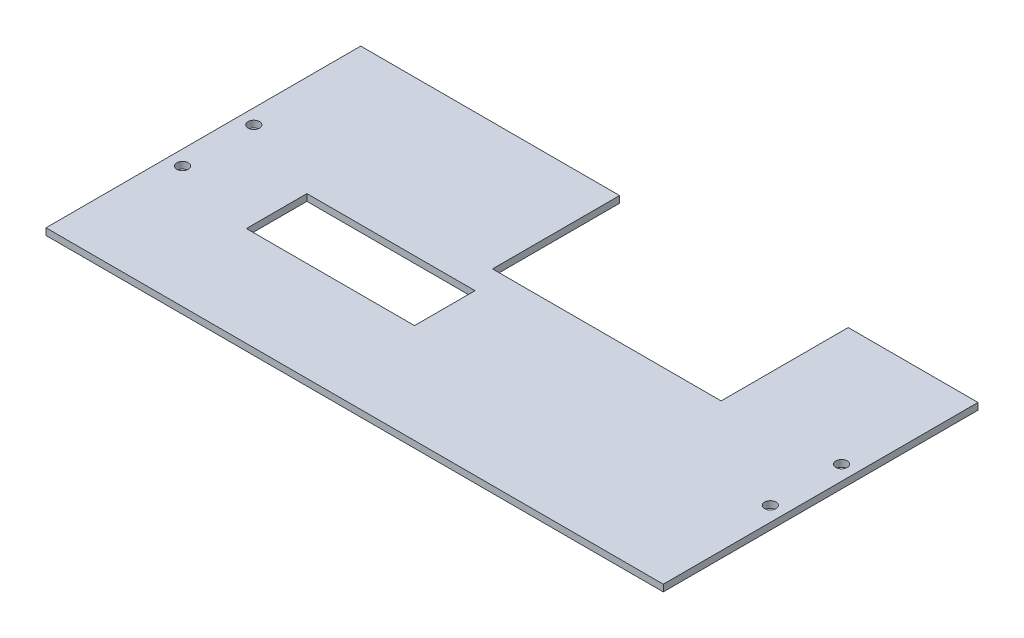
ISO-10303-21;
HEADER;
FILE_DESCRIPTION(('STEP AP214'),'2;1');
FILE_NAME('part.step','',(''),(''),'','','');
FILE_SCHEMA(('AUTOMOTIVE_DESIGN { 1 0 10303 214 1 1 1 1 }'));
ENDSEC;
DATA;
#1=APPLICATION_CONTEXT('core data for automotive mechanical design processes');
#2=APPLICATION_PROTOCOL_DEFINITION('international standard','automotive_design',2000,#1);
#3=PRODUCT_CONTEXT('',#1,'mechanical');
#4=PRODUCT('Part','Part','',(#3));
#5=PRODUCT_RELATED_PRODUCT_CATEGORY('part','',(#4));
#6=PRODUCT_DEFINITION_FORMATION('','',#4);
#7=PRODUCT_DEFINITION_CONTEXT('part definition',#1,'design');
#8=PRODUCT_DEFINITION('design','',#6,#7);
#9=PRODUCT_DEFINITION_SHAPE('','',#8);
#10=(LENGTH_UNIT() NAMED_UNIT(*) SI_UNIT(.MILLI.,.METRE.));
#11=(NAMED_UNIT(*) PLANE_ANGLE_UNIT() SI_UNIT($,.RADIAN.));
#12=(NAMED_UNIT(*) SI_UNIT($,.STERADIAN.) SOLID_ANGLE_UNIT());
#13=UNCERTAINTY_MEASURE_WITH_UNIT(LENGTH_MEASURE(1.E-05),#10,'distance_accuracy_value','');
#14=(GEOMETRIC_REPRESENTATION_CONTEXT(3) GLOBAL_UNCERTAINTY_ASSIGNED_CONTEXT((#13)) GLOBAL_UNIT_ASSIGNED_CONTEXT((#10,
#11,#12)) REPRESENTATION_CONTEXT('',''));
#15=CARTESIAN_POINT('',(0.,0.,0.));
#16=DIRECTION('',(0.,0.,1.));
#17=DIRECTION('',(1.,0.,0.));
#18=AXIS2_PLACEMENT_3D('',#15,#16,#17);
#19=CARTESIAN_POINT('',(-116.586,2.54,-59.440191));
#20=DIRECTION('',(0.,0.,1.));
#21=DIRECTION('',(1.,0.,0.));
#22=AXIS2_PLACEMENT_3D('',#19,#20,#21);
#23=PLANE('',#22);
#24=DIRECTION('',(-1.,0.,0.));
#25=VECTOR('',#24,1.);
#26=CARTESIAN_POINT('',(-116.586,2.54,-59.440191));
#27=LINE('',#26,#25);
#28=CARTESIAN_POINT('',(-18.800318,2.54,-59.440191));
#29=VERTEX_POINT('',#28);
#30=CARTESIAN_POINT('',(-116.586,2.54,-59.440191));
#31=VERTEX_POINT('',#30);
#32=EDGE_CURVE('E206',#29,#31,#27,.T.);
#33=ORIENTED_EDGE('',*,*,#32,.F.);
#34=DIRECTION('',(0.,1.,0.));
#35=VECTOR('',#34,1.);
#36=CARTESIAN_POINT('',(-18.800318,0.,-59.440191));
#37=LINE('',#36,#35);
#38=CARTESIAN_POINT('',(-18.800318,0.,-59.440191));
#39=VERTEX_POINT('',#38);
#40=EDGE_CURVE('E260',#39,#29,#37,.T.);
#41=ORIENTED_EDGE('',*,*,#40,.F.);
#42=DIRECTION('',(-1.,0.,0.));
#43=VECTOR('',#42,1.);
#44=CARTESIAN_POINT('',(-116.586,0.,-59.440191));
#45=LINE('',#44,#43);
#46=CARTESIAN_POINT('',(-116.586,0.,-59.440191));
#47=VERTEX_POINT('',#46);
#48=EDGE_CURVE('E221',#39,#47,#45,.T.);
#49=ORIENTED_EDGE('',*,*,#48,.T.);
#50=DIRECTION('',(0.,-1.,0.));
#51=VECTOR('',#50,1.);
#52=CARTESIAN_POINT('',(-116.586,2.54,-59.440191));
#53=LINE('',#52,#51);
#54=EDGE_CURVE('E51',#31,#47,#53,.T.);
#55=ORIENTED_EDGE('',*,*,#54,.F.);
#56=EDGE_LOOP('',(#33,#41,#49,#55));
#57=FACE_BOUND('',#56,.T.);
#58=ADVANCED_FACE('F43',(#57),#23,.F.);
#59=CARTESIAN_POINT('',(116.586,2.54,59.440191));
#60=DIRECTION('',(-1.,0.,0.));
#61=DIRECTION('',(0.,0.,1.));
#62=AXIS2_PLACEMENT_3D('',#59,#60,#61);
#63=PLANE('',#62);
#64=DIRECTION('',(0.,0.,-1.));
#65=VECTOR('',#64,1.);
#66=CARTESIAN_POINT('',(116.586,0.,59.440191));
#67=LINE('',#66,#65);
#68=CARTESIAN_POINT('',(116.586,0.,59.440191));
#69=VERTEX_POINT('',#68);
#70=CARTESIAN_POINT('',(116.586,0.,-59.440191));
#71=VERTEX_POINT('',#70);
#72=EDGE_CURVE('E218',#69,#71,#67,.T.);
#73=ORIENTED_EDGE('',*,*,#72,.T.);
#74=DIRECTION('',(0.,-1.,0.));
#75=VECTOR('',#74,1.);
#76=CARTESIAN_POINT('',(116.586,2.54,-59.440191));
#77=LINE('',#76,#75);
#78=CARTESIAN_POINT('',(116.586,2.54,-59.440191));
#79=VERTEX_POINT('',#78);
#80=EDGE_CURVE('E12',#79,#71,#77,.T.);
#81=ORIENTED_EDGE('',*,*,#80,.F.);
#82=DIRECTION('',(0.,0.,-1.));
#83=VECTOR('',#82,1.);
#84=CARTESIAN_POINT('',(116.586,2.54,59.440191));
#85=LINE('',#84,#83);
#86=CARTESIAN_POINT('',(116.586,2.54,59.440191));
#87=VERTEX_POINT('',#86);
#88=EDGE_CURVE('E207',#87,#79,#85,.T.);
#89=ORIENTED_EDGE('',*,*,#88,.F.);
#90=DIRECTION('',(0.,-1.,0.));
#91=VECTOR('',#90,1.);
#92=CARTESIAN_POINT('',(116.586,2.54,59.440191));
#93=LINE('',#92,#91);
#94=EDGE_CURVE('E217',#87,#69,#93,.T.);
#95=ORIENTED_EDGE('',*,*,#94,.T.);
#96=EDGE_LOOP('',(#73,#81,#89,#95));
#97=FACE_BOUND('',#96,.T.);
#98=ADVANCED_FACE('F45',(#97),#63,.F.);
#99=CARTESIAN_POINT('',(67.5596820000002,0.,-59.440191));
#100=VERTEX_POINT('',#99);
#101=EDGE_CURVE('E223',#71,#100,#45,.T.);
#102=ORIENTED_EDGE('',*,*,#101,.T.);
#103=DIRECTION('',(0.,1.,0.));
#104=VECTOR('',#103,1.);
#105=CARTESIAN_POINT('',(67.5596820000002,0.,-59.440191));
#106=LINE('',#105,#104);
#107=CARTESIAN_POINT('',(67.5596820000002,2.54,-59.440191));
#108=VERTEX_POINT('',#107);
#109=EDGE_CURVE('E263',#100,#108,#106,.T.);
#110=ORIENTED_EDGE('',*,*,#109,.T.);
#111=EDGE_CURVE('E201',#79,#108,#27,.T.);
#112=ORIENTED_EDGE('',*,*,#111,.F.);
#113=ORIENTED_EDGE('',*,*,#80,.T.);
#114=EDGE_LOOP('',(#102,#110,#112,#113));
#115=FACE_BOUND('',#114,.T.);
#116=ADVANCED_FACE('F318',(#115),#23,.F.);
#117=CARTESIAN_POINT('',(-116.586,2.54,59.440191));
#118=DIRECTION('',(1.,0.,0.));
#119=DIRECTION('',(0.,0.,-1.));
#120=AXIS2_PLACEMENT_3D('',#117,#118,#119);
#121=PLANE('',#120);
#122=DIRECTION('',(0.,0.,1.));
#123=VECTOR('',#122,1.);
#124=CARTESIAN_POINT('',(-116.586,0.,59.440191));
#125=LINE('',#124,#123);
#126=CARTESIAN_POINT('',(-116.586,0.,59.440191));
#127=VERTEX_POINT('',#126);
#128=EDGE_CURVE('E226',#47,#127,#125,.T.);
#129=ORIENTED_EDGE('',*,*,#128,.T.);
#130=DIRECTION('',(0.,-1.,0.));
#131=VECTOR('',#130,1.);
#132=CARTESIAN_POINT('',(-116.586,2.54,59.440191));
#133=LINE('',#132,#131);
#134=CARTESIAN_POINT('',(-116.586,2.54,59.440191));
#135=VERTEX_POINT('',#134);
#136=EDGE_CURVE('E232',#135,#127,#133,.T.);
#137=ORIENTED_EDGE('',*,*,#136,.F.);
#138=DIRECTION('',(0.,0.,1.));
#139=VECTOR('',#138,1.);
#140=CARTESIAN_POINT('',(-116.586,2.54,59.440191));
#141=LINE('',#140,#139);
#142=EDGE_CURVE('E205',#31,#135,#141,.T.);
#143=ORIENTED_EDGE('',*,*,#142,.F.);
#144=ORIENTED_EDGE('',*,*,#54,.T.);
#145=EDGE_LOOP('',(#129,#137,#143,#144));
#146=FACE_BOUND('',#145,.T.);
#147=ADVANCED_FACE('F239',(#146),#121,.F.);
#148=CARTESIAN_POINT('',(-116.586,2.54,59.440191));
#149=DIRECTION('',(0.,0.,-1.));
#150=DIRECTION('',(-1.,0.,0.));
#151=AXIS2_PLACEMENT_3D('',#148,#149,#150);
#152=PLANE('',#151);
#153=DIRECTION('',(1.,0.,0.));
#154=VECTOR('',#153,1.);
#155=CARTESIAN_POINT('',(-116.586,0.,59.440191));
#156=LINE('',#155,#154);
#157=EDGE_CURVE('E228',#127,#69,#156,.T.);
#158=ORIENTED_EDGE('',*,*,#157,.T.);
#159=ORIENTED_EDGE('',*,*,#94,.F.);
#160=DIRECTION('',(1.,0.,0.));
#161=VECTOR('',#160,1.);
#162=CARTESIAN_POINT('',(-116.586,2.54,59.440191));
#163=LINE('',#162,#161);
#164=EDGE_CURVE('E214',#135,#87,#163,.T.);
#165=ORIENTED_EDGE('',*,*,#164,.F.);
#166=ORIENTED_EDGE('',*,*,#136,.T.);
#167=EDGE_LOOP('',(#158,#159,#165,#166));
#168=FACE_BOUND('',#167,.T.);
#169=ADVANCED_FACE('F249',(#168),#152,.F.);
#170=CARTESIAN_POINT('',(0.,2.54,0.));
#171=DIRECTION('',(0.,-1.,0.));
#172=DIRECTION('',(0.,0.,-1.));
#173=AXIS2_PLACEMENT_3D('',#170,#171,#172);
#174=PLANE('',#173);
#175=DIRECTION('',(1.,0.,0.));
#176=VECTOR('',#175,1.);
#177=CARTESIAN_POINT('',(-78.486,2.54,21.839809));
#178=LINE('',#177,#176);
#179=CARTESIAN_POINT('',(-78.486,2.54,21.839809));
#180=VERTEX_POINT('',#179);
#181=CARTESIAN_POINT('',(-14.986,2.54,21.839809));
#182=VERTEX_POINT('',#181);
#183=EDGE_CURVE('E160',#180,#182,#178,.T.);
#184=ORIENTED_EDGE('',*,*,#183,.F.);
#185=DIRECTION('',(0.,0.,1.));
#186=VECTOR('',#185,1.);
#187=CARTESIAN_POINT('',(-78.486,2.54,-1.020191));
#188=LINE('',#187,#186);
#189=CARTESIAN_POINT('',(-78.486,2.54,-1.020191));
#190=VERTEX_POINT('',#189);
#191=EDGE_CURVE('E58',#190,#180,#188,.T.);
#192=ORIENTED_EDGE('',*,*,#191,.F.);
#193=DIRECTION('',(-1.,0.,0.));
#194=VECTOR('',#193,1.);
#195=CARTESIAN_POINT('',(-78.486,2.54,-1.020191));
#196=LINE('',#195,#194);
#197=CARTESIAN_POINT('',(-14.986,2.54,-1.020191));
#198=VERTEX_POINT('',#197);
#199=EDGE_CURVE('E150',#198,#190,#196,.T.);
#200=ORIENTED_EDGE('',*,*,#199,.F.);
#201=DIRECTION('',(0.,0.,-1.));
#202=VECTOR('',#201,1.);
#203=CARTESIAN_POINT('',(-14.986,2.54,-1.020191));
#204=LINE('',#203,#202);
#205=EDGE_CURVE('E153',#182,#198,#204,.T.);
#206=ORIENTED_EDGE('',*,*,#205,.F.);
#207=EDGE_LOOP('',(#184,#192,#200,#206));
#208=FACE_BOUND('',#207,.T.);
#209=CARTESIAN_POINT('',(111.0107,2.54,-13.474573));
#210=DIRECTION('',(0.,1.,0.));
#211=DIRECTION('',(0.,0.,1.));
#212=AXIS2_PLACEMENT_3D('',#209,#210,#211);
#213=CIRCLE('',#212,2.15264999999999);
#214=CARTESIAN_POINT('',(111.0107,2.54,-11.321923));
#215=VERTEX_POINT('',#214);
#216=EDGE_CURVE('E262',#215,#215,#213,.T.);
#217=ORIENTED_EDGE('',*,*,#216,.F.);
#218=EDGE_LOOP('',(#217));
#219=FACE_BOUND('',#218,.T.);
#220=CARTESIAN_POINT('',(111.0107,2.54,13.4511034));
#221=DIRECTION('',(0.,1.,0.));
#222=DIRECTION('',(0.,0.,1.));
#223=AXIS2_PLACEMENT_3D('',#220,#221,#222);
#224=CIRCLE('',#223,2.15264999999999);
#225=CARTESIAN_POINT('',(111.0107,2.54,15.6037534));
#226=VERTEX_POINT('',#225);
#227=EDGE_CURVE('E280',#226,#226,#224,.T.);
#228=ORIENTED_EDGE('',*,*,#227,.F.);
#229=EDGE_LOOP('',(#228));
#230=FACE_BOUND('',#229,.T.);
#231=CARTESIAN_POINT('',(-111.0107,2.54,-13.474573));
#232=DIRECTION('',(0.,1.,0.));
#233=DIRECTION('',(0.,0.,1.));
#234=AXIS2_PLACEMENT_3D('',#231,#232,#233);
#235=CIRCLE('',#234,2.15264999999999);
#236=CARTESIAN_POINT('',(-111.0107,2.54,-11.321923));
#237=VERTEX_POINT('',#236);
#238=EDGE_CURVE('E286',#237,#237,#235,.T.);
#239=ORIENTED_EDGE('',*,*,#238,.F.);
#240=EDGE_LOOP('',(#239));
#241=FACE_BOUND('',#240,.T.);
#242=CARTESIAN_POINT('',(-111.0107,2.54,13.4511034));
#243=DIRECTION('',(0.,1.,0.));
#244=DIRECTION('',(0.,0.,1.));
#245=AXIS2_PLACEMENT_3D('',#242,#243,#244);
#246=CIRCLE('',#245,2.15264999999999);
#247=CARTESIAN_POINT('',(-111.0107,2.54,15.6037534));
#248=VERTEX_POINT('',#247);
#249=EDGE_CURVE('E293',#248,#248,#246,.T.);
#250=ORIENTED_EDGE('',*,*,#249,.F.);
#251=EDGE_LOOP('',(#250));
#252=FACE_BOUND('',#251,.T.);
#253=DIRECTION('',(1.,0.,0.));
#254=VECTOR('',#253,1.);
#255=CARTESIAN_POINT('',(-18.800318,2.54,-11.434191));
#256=LINE('',#255,#254);
#257=CARTESIAN_POINT('',(-18.800318,2.54,-11.434191));
#258=VERTEX_POINT('',#257);
#259=CARTESIAN_POINT('',(67.5596820000002,2.54,-11.434191));
#260=VERTEX_POINT('',#259);
#261=EDGE_CURVE('E191',#258,#260,#256,.T.);
#262=ORIENTED_EDGE('',*,*,#261,.F.);
#263=DIRECTION('',(0.,0.,1.));
#264=VECTOR('',#263,1.);
#265=CARTESIAN_POINT('',(-18.800318,2.54,-59.440191));
#266=LINE('',#265,#264);
#267=EDGE_CURVE('E173',#29,#258,#266,.T.);
#268=ORIENTED_EDGE('',*,*,#267,.F.);
#269=ORIENTED_EDGE('',*,*,#32,.T.);
#270=ORIENTED_EDGE('',*,*,#142,.T.);
#271=ORIENTED_EDGE('',*,*,#164,.T.);
#272=ORIENTED_EDGE('',*,*,#88,.T.);
#273=ORIENTED_EDGE('',*,*,#111,.T.);
#274=DIRECTION('',(0.,0.,-1.));
#275=VECTOR('',#274,1.);
#276=CARTESIAN_POINT('',(67.5596820000002,2.54,-59.440191));
#277=LINE('',#276,#275);
#278=EDGE_CURVE('E181',#260,#108,#277,.T.);
#279=ORIENTED_EDGE('',*,*,#278,.F.);
#280=EDGE_LOOP('',(#262,#268,#269,#270,#271,#272,#273,#279));
#281=FACE_BOUND('',#280,.T.);
#282=ADVANCED_FACE('F258',(#208,#219,#230,#241,#252,#281),#174,.F.);
#283=CARTESIAN_POINT('',(0.,0.,0.));
#284=DIRECTION('',(0.,-1.,0.));
#285=DIRECTION('',(0.,0.,-1.));
#286=AXIS2_PLACEMENT_3D('',#283,#284,#285);
#287=PLANE('',#286);
#288=DIRECTION('',(0.,0.,1.));
#289=VECTOR('',#288,1.);
#290=CARTESIAN_POINT('',(-78.486,0.,-1.020191));
#291=LINE('',#290,#289);
#292=CARTESIAN_POINT('',(-78.486,0.,-1.020191));
#293=VERTEX_POINT('',#292);
#294=CARTESIAN_POINT('',(-78.486,0.,21.839809));
#295=VERTEX_POINT('',#294);
#296=EDGE_CURVE('E134',#293,#295,#291,.T.);
#297=ORIENTED_EDGE('',*,*,#296,.T.);
#298=DIRECTION('',(1.,0.,0.));
#299=VECTOR('',#298,1.);
#300=CARTESIAN_POINT('',(-78.486,0.,21.839809));
#301=LINE('',#300,#299);
#302=CARTESIAN_POINT('',(-14.986,0.,21.839809));
#303=VERTEX_POINT('',#302);
#304=EDGE_CURVE('E143',#295,#303,#301,.T.);
#305=ORIENTED_EDGE('',*,*,#304,.T.);
#306=DIRECTION('',(0.,0.,-1.));
#307=VECTOR('',#306,1.);
#308=CARTESIAN_POINT('',(-14.986,0.,-1.020191));
#309=LINE('',#308,#307);
#310=CARTESIAN_POINT('',(-14.986,0.,-1.020191));
#311=VERTEX_POINT('',#310);
#312=EDGE_CURVE('E66',#303,#311,#309,.T.);
#313=ORIENTED_EDGE('',*,*,#312,.T.);
#314=DIRECTION('',(-1.,0.,0.));
#315=VECTOR('',#314,1.);
#316=CARTESIAN_POINT('',(-78.486,0.,-1.020191));
#317=LINE('',#316,#315);
#318=EDGE_CURVE('E140',#311,#293,#317,.T.);
#319=ORIENTED_EDGE('',*,*,#318,.T.);
#320=EDGE_LOOP('',(#297,#305,#313,#319));
#321=FACE_BOUND('',#320,.T.);
#322=DIRECTION('',(0.,0.,1.));
#323=VECTOR('',#322,1.);
#324=CARTESIAN_POINT('',(-18.800318,0.,-59.440191));
#325=LINE('',#324,#323);
#326=CARTESIAN_POINT('',(-18.800318,0.,-11.434191));
#327=VERTEX_POINT('',#326);
#328=EDGE_CURVE('E177',#39,#327,#325,.T.);
#329=ORIENTED_EDGE('',*,*,#328,.T.);
#330=DIRECTION('',(1.,0.,0.));
#331=VECTOR('',#330,1.);
#332=CARTESIAN_POINT('',(-18.800318,0.,-11.434191));
#333=LINE('',#332,#331);
#334=CARTESIAN_POINT('',(67.5596820000002,0.,-11.434191));
#335=VERTEX_POINT('',#334);
#336=EDGE_CURVE('E180',#327,#335,#333,.T.);
#337=ORIENTED_EDGE('',*,*,#336,.T.);
#338=DIRECTION('',(0.,0.,-1.));
#339=VECTOR('',#338,1.);
#340=CARTESIAN_POINT('',(67.5596820000002,0.,-59.440191));
#341=LINE('',#340,#339);
#342=EDGE_CURVE('E184',#335,#100,#341,.T.);
#343=ORIENTED_EDGE('',*,*,#342,.T.);
#344=ORIENTED_EDGE('',*,*,#101,.F.);
#345=ORIENTED_EDGE('',*,*,#72,.F.);
#346=ORIENTED_EDGE('',*,*,#157,.F.);
#347=ORIENTED_EDGE('',*,*,#128,.F.);
#348=ORIENTED_EDGE('',*,*,#48,.F.);
#349=EDGE_LOOP('',(#329,#337,#343,#344,#345,#346,#347,#348));
#350=FACE_BOUND('',#349,.T.);
#351=CARTESIAN_POINT('',(111.0107,0.,-13.474573));
#352=DIRECTION('',(0.,1.,0.));
#353=DIRECTION('',(0.,0.,1.));
#354=AXIS2_PLACEMENT_3D('',#351,#352,#353);
#355=CIRCLE('',#354,2.15264999999999);
#356=CARTESIAN_POINT('',(111.0107,0.,-11.321923));
#357=VERTEX_POINT('',#356);
#358=EDGE_CURVE('E266',#357,#357,#355,.T.);
#359=ORIENTED_EDGE('',*,*,#358,.T.);
#360=EDGE_LOOP('',(#359));
#361=FACE_BOUND('',#360,.T.);
#362=CARTESIAN_POINT('',(111.0107,0.,13.4511034));
#363=DIRECTION('',(0.,1.,0.));
#364=DIRECTION('',(0.,0.,1.));
#365=AXIS2_PLACEMENT_3D('',#362,#363,#364);
#366=CIRCLE('',#365,2.15264999999999);
#367=CARTESIAN_POINT('',(111.0107,0.,15.6037534));
#368=VERTEX_POINT('',#367);
#369=EDGE_CURVE('E284',#368,#368,#366,.T.);
#370=ORIENTED_EDGE('',*,*,#369,.T.);
#371=EDGE_LOOP('',(#370));
#372=FACE_BOUND('',#371,.T.);
#373=CARTESIAN_POINT('',(-111.0107,0.,-13.474573));
#374=DIRECTION('',(0.,1.,0.));
#375=DIRECTION('',(0.,0.,1.));
#376=AXIS2_PLACEMENT_3D('',#373,#374,#375);
#377=CIRCLE('',#376,2.15264999999999);
#378=CARTESIAN_POINT('',(-111.0107,0.,-11.321923));
#379=VERTEX_POINT('',#378);
#380=EDGE_CURVE('E290',#379,#379,#377,.T.);
#381=ORIENTED_EDGE('',*,*,#380,.T.);
#382=EDGE_LOOP('',(#381));
#383=FACE_BOUND('',#382,.T.);
#384=CARTESIAN_POINT('',(-111.0107,0.,13.4511034));
#385=DIRECTION('',(0.,1.,0.));
#386=DIRECTION('',(0.,0.,1.));
#387=AXIS2_PLACEMENT_3D('',#384,#385,#386);
#388=CIRCLE('',#387,2.15264999999999);
#389=CARTESIAN_POINT('',(-111.0107,0.,15.6037534));
#390=VERTEX_POINT('',#389);
#391=EDGE_CURVE('E222',#390,#390,#388,.T.);
#392=ORIENTED_EDGE('',*,*,#391,.T.);
#393=EDGE_LOOP('',(#392));
#394=FACE_BOUND('',#393,.T.);
#395=ADVANCED_FACE('F147',(#321,#350,#361,#372,#383,#394),#287,.T.);
#396=CARTESIAN_POINT('',(-111.0107,2.54,13.4511034));
#397=DIRECTION('',(0.,1.,0.));
#398=DIRECTION('',(0.,0.,1.));
#399=AXIS2_PLACEMENT_3D('',#396,#397,#398);
#400=CYLINDRICAL_SURFACE('',#399,2.15264999999999);
#401=ORIENTED_EDGE('',*,*,#391,.F.);
#402=EDGE_LOOP('',(#401));
#403=FACE_BOUND('',#402,.T.);
#404=ORIENTED_EDGE('',*,*,#249,.T.);
#405=EDGE_LOOP('',(#404));
#406=FACE_BOUND('',#405,.T.);
#407=ADVANCED_FACE('F300',(#403,#406),#400,.F.);
#408=CARTESIAN_POINT('',(-111.0107,2.54,-13.474573));
#409=DIRECTION('',(0.,1.,0.));
#410=DIRECTION('',(0.,0.,1.));
#411=AXIS2_PLACEMENT_3D('',#408,#409,#410);
#412=CYLINDRICAL_SURFACE('',#411,2.15264999999999);
#413=ORIENTED_EDGE('',*,*,#380,.F.);
#414=EDGE_LOOP('',(#413));
#415=FACE_BOUND('',#414,.T.);
#416=ORIENTED_EDGE('',*,*,#238,.T.);
#417=EDGE_LOOP('',(#416));
#418=FACE_BOUND('',#417,.T.);
#419=ADVANCED_FACE('F303',(#415,#418),#412,.F.);
#420=CARTESIAN_POINT('',(111.0107,2.54,13.4511034));
#421=DIRECTION('',(0.,1.,0.));
#422=DIRECTION('',(0.,0.,1.));
#423=AXIS2_PLACEMENT_3D('',#420,#421,#422);
#424=CYLINDRICAL_SURFACE('',#423,2.15264999999999);
#425=ORIENTED_EDGE('',*,*,#369,.F.);
#426=EDGE_LOOP('',(#425));
#427=FACE_BOUND('',#426,.T.);
#428=ORIENTED_EDGE('',*,*,#227,.T.);
#429=EDGE_LOOP('',(#428));
#430=FACE_BOUND('',#429,.T.);
#431=ADVANCED_FACE('F345',(#427,#430),#424,.F.);
#432=CARTESIAN_POINT('',(111.0107,2.54,-13.474573));
#433=DIRECTION('',(0.,1.,0.));
#434=DIRECTION('',(0.,0.,1.));
#435=AXIS2_PLACEMENT_3D('',#432,#433,#434);
#436=CYLINDRICAL_SURFACE('',#435,2.15264999999999);
#437=ORIENTED_EDGE('',*,*,#358,.F.);
#438=EDGE_LOOP('',(#437));
#439=FACE_BOUND('',#438,.T.);
#440=ORIENTED_EDGE('',*,*,#216,.T.);
#441=EDGE_LOOP('',(#440));
#442=FACE_BOUND('',#441,.T.);
#443=ADVANCED_FACE('F338',(#439,#442),#436,.F.);
#444=CARTESIAN_POINT('',(-18.800318,0.,-59.440191));
#445=DIRECTION('',(-1.,0.,0.));
#446=DIRECTION('',(0.,0.,1.));
#447=AXIS2_PLACEMENT_3D('',#444,#445,#446);
#448=PLANE('',#447);
#449=ORIENTED_EDGE('',*,*,#267,.T.);
#450=DIRECTION('',(0.,1.,0.));
#451=VECTOR('',#450,1.);
#452=CARTESIAN_POINT('',(-18.800318,0.,-11.434191));
#453=LINE('',#452,#451);
#454=EDGE_CURVE('E187',#327,#258,#453,.T.);
#455=ORIENTED_EDGE('',*,*,#454,.F.);
#456=ORIENTED_EDGE('',*,*,#328,.F.);
#457=ORIENTED_EDGE('',*,*,#40,.T.);
#458=EDGE_LOOP('',(#449,#455,#456,#457));
#459=FACE_BOUND('',#458,.T.);
#460=ADVANCED_FACE('F336',(#459),#448,.F.);
#461=CARTESIAN_POINT('',(67.5596820000002,0.,-59.440191));
#462=DIRECTION('',(1.,0.,0.));
#463=DIRECTION('',(0.,0.,-1.));
#464=AXIS2_PLACEMENT_3D('',#461,#462,#463);
#465=PLANE('',#464);
#466=ORIENTED_EDGE('',*,*,#278,.T.);
#467=ORIENTED_EDGE('',*,*,#109,.F.);
#468=ORIENTED_EDGE('',*,*,#342,.F.);
#469=DIRECTION('',(0.,1.,0.));
#470=VECTOR('',#469,1.);
#471=CARTESIAN_POINT('',(67.5596820000002,0.,-11.434191));
#472=LINE('',#471,#470);
#473=EDGE_CURVE('E269',#335,#260,#472,.T.);
#474=ORIENTED_EDGE('',*,*,#473,.T.);
#475=EDGE_LOOP('',(#466,#467,#468,#474));
#476=FACE_BOUND('',#475,.T.);
#477=ADVANCED_FACE('F331',(#476),#465,.F.);
#478=CARTESIAN_POINT('',(-18.800318,0.,-11.434191));
#479=DIRECTION('',(0.,0.,1.));
#480=DIRECTION('',(1.,0.,0.));
#481=AXIS2_PLACEMENT_3D('',#478,#479,#480);
#482=PLANE('',#481);
#483=ORIENTED_EDGE('',*,*,#261,.T.);
#484=ORIENTED_EDGE('',*,*,#473,.F.);
#485=ORIENTED_EDGE('',*,*,#336,.F.);
#486=ORIENTED_EDGE('',*,*,#454,.T.);
#487=EDGE_LOOP('',(#483,#484,#485,#486));
#488=FACE_BOUND('',#487,.T.);
#489=ADVANCED_FACE('F334',(#488),#482,.F.);
#490=CARTESIAN_POINT('',(-78.486,0.,-1.020191));
#491=DIRECTION('',(-1.,0.,0.));
#492=DIRECTION('',(0.,0.,1.));
#493=AXIS2_PLACEMENT_3D('',#490,#491,#492);
#494=PLANE('',#493);
#495=ORIENTED_EDGE('',*,*,#191,.T.);
#496=DIRECTION('',(0.,1.,0.));
#497=VECTOR('',#496,1.);
#498=CARTESIAN_POINT('',(-78.486,0.,21.839809));
#499=LINE('',#498,#497);
#500=EDGE_CURVE('E130',#295,#180,#499,.T.);
#501=ORIENTED_EDGE('',*,*,#500,.F.);
#502=ORIENTED_EDGE('',*,*,#296,.F.);
#503=DIRECTION('',(0.,1.,0.));
#504=VECTOR('',#503,1.);
#505=CARTESIAN_POINT('',(-78.486,0.,-1.020191));
#506=LINE('',#505,#504);
#507=EDGE_CURVE('E171',#293,#190,#506,.T.);
#508=ORIENTED_EDGE('',*,*,#507,.T.);
#509=EDGE_LOOP('',(#495,#501,#502,#508));
#510=FACE_BOUND('',#509,.T.);
#511=ADVANCED_FACE('F132',(#510),#494,.F.);
#512=CARTESIAN_POINT('',(-78.486,0.,-1.020191));
#513=DIRECTION('',(0.,0.,-1.));
#514=DIRECTION('',(-1.,0.,0.));
#515=AXIS2_PLACEMENT_3D('',#512,#513,#514);
#516=PLANE('',#515);
#517=ORIENTED_EDGE('',*,*,#199,.T.);
#518=ORIENTED_EDGE('',*,*,#507,.F.);
#519=ORIENTED_EDGE('',*,*,#318,.F.);
#520=DIRECTION('',(0.,1.,0.));
#521=VECTOR('',#520,1.);
#522=CARTESIAN_POINT('',(-14.986,0.,-1.020191));
#523=LINE('',#522,#521);
#524=EDGE_CURVE('E174',#311,#198,#523,.T.);
#525=ORIENTED_EDGE('',*,*,#524,.T.);
#526=EDGE_LOOP('',(#517,#518,#519,#525));
#527=FACE_BOUND('',#526,.T.);
#528=ADVANCED_FACE('F422',(#527),#516,.F.);
#529=CARTESIAN_POINT('',(-14.986,0.,-1.020191));
#530=DIRECTION('',(1.,0.,0.));
#531=DIRECTION('',(0.,0.,-1.));
#532=AXIS2_PLACEMENT_3D('',#529,#530,#531);
#533=PLANE('',#532);
#534=ORIENTED_EDGE('',*,*,#205,.T.);
#535=ORIENTED_EDGE('',*,*,#524,.F.);
#536=ORIENTED_EDGE('',*,*,#312,.F.);
#537=DIRECTION('',(0.,1.,0.));
#538=VECTOR('',#537,1.);
#539=CARTESIAN_POINT('',(-14.986,0.,21.839809));
#540=LINE('',#539,#538);
#541=EDGE_CURVE('E139',#303,#182,#540,.T.);
#542=ORIENTED_EDGE('',*,*,#541,.T.);
#543=EDGE_LOOP('',(#534,#535,#536,#542));
#544=FACE_BOUND('',#543,.T.);
#545=ADVANCED_FACE('F431',(#544),#533,.F.);
#546=CARTESIAN_POINT('',(-78.486,0.,21.839809));
#547=DIRECTION('',(0.,0.,1.));
#548=DIRECTION('',(1.,0.,0.));
#549=AXIS2_PLACEMENT_3D('',#546,#547,#548);
#550=PLANE('',#549);
#551=ORIENTED_EDGE('',*,*,#183,.T.);
#552=ORIENTED_EDGE('',*,*,#541,.F.);
#553=ORIENTED_EDGE('',*,*,#304,.F.);
#554=ORIENTED_EDGE('',*,*,#500,.T.);
#555=EDGE_LOOP('',(#551,#552,#553,#554));
#556=FACE_BOUND('',#555,.T.);
#557=ADVANCED_FACE('F144',(#556),#550,.F.);
#558=CLOSED_SHELL('',(#58,#98,#116,#147,#169,#282,#395,#407,#419,#431,#443,#460,#477,#489,#511,
#528,#545,#557));
#559=MANIFOLD_SOLID_BREP('B2',#558);
#560=ADVANCED_BREP_SHAPE_REPRESENTATION('',(#18,#559),#14);
#561=SHAPE_DEFINITION_REPRESENTATION(#9,#560);
ENDSEC;
END-ISO-10303-21;
